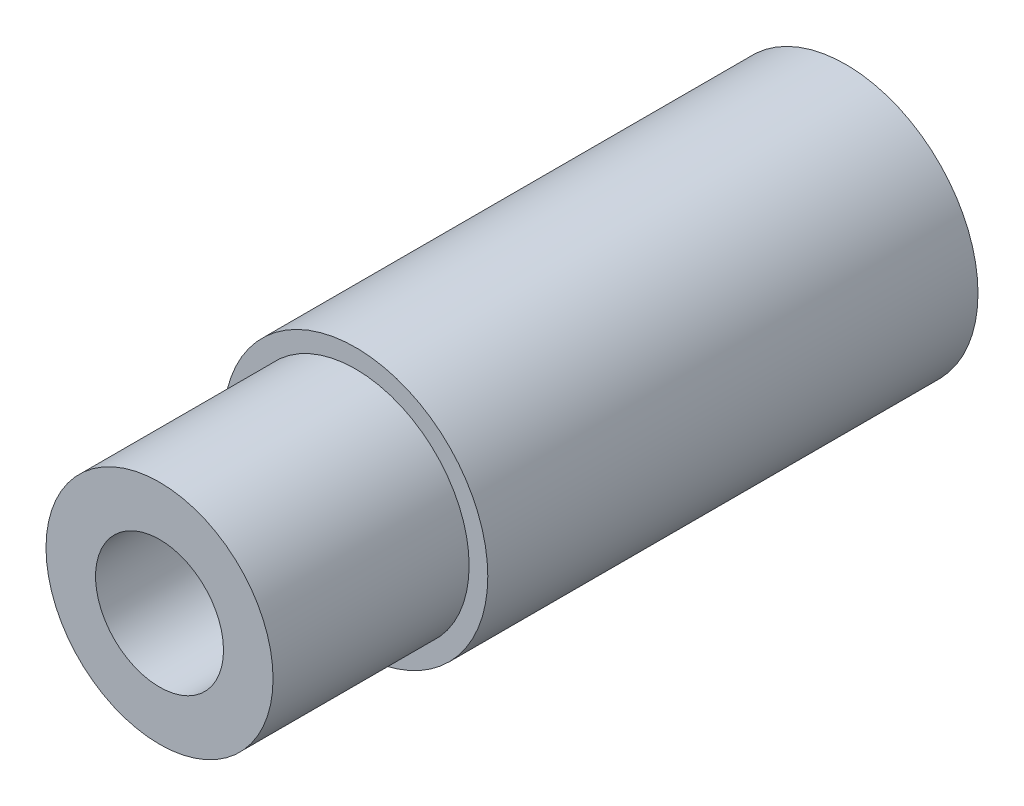
ISO-10303-21;
HEADER;
FILE_DESCRIPTION(('STEP AP214'),'2;1');
FILE_NAME('part.step','',(''),(''),'','','');
FILE_SCHEMA(('AUTOMOTIVE_DESIGN { 1 0 10303 214 1 1 1 1 }'));
ENDSEC;
DATA;
#1=APPLICATION_CONTEXT('core data for automotive mechanical design processes');
#2=APPLICATION_PROTOCOL_DEFINITION('international standard','automotive_design',2000,#1);
#3=PRODUCT_CONTEXT('',#1,'mechanical');
#4=PRODUCT('Part','Part','',(#3));
#5=PRODUCT_RELATED_PRODUCT_CATEGORY('part','',(#4));
#6=PRODUCT_DEFINITION_FORMATION('','',#4);
#7=PRODUCT_DEFINITION_CONTEXT('part definition',#1,'design');
#8=PRODUCT_DEFINITION('design','',#6,#7);
#9=PRODUCT_DEFINITION_SHAPE('','',#8);
#10=(LENGTH_UNIT() NAMED_UNIT(*) SI_UNIT(.MILLI.,.METRE.));
#11=(NAMED_UNIT(*) PLANE_ANGLE_UNIT() SI_UNIT($,.RADIAN.));
#12=(NAMED_UNIT(*) SI_UNIT($,.STERADIAN.) SOLID_ANGLE_UNIT());
#13=UNCERTAINTY_MEASURE_WITH_UNIT(LENGTH_MEASURE(1.E-05),#10,'distance_accuracy_value','');
#14=(GEOMETRIC_REPRESENTATION_CONTEXT(3) GLOBAL_UNCERTAINTY_ASSIGNED_CONTEXT((#13)) GLOBAL_UNIT_ASSIGNED_CONTEXT((#10,
#11,#12)) REPRESENTATION_CONTEXT('',''));
#15=CARTESIAN_POINT('',(0.,0.,0.));
#16=DIRECTION('',(0.,0.,1.));
#17=DIRECTION('',(1.,0.,0.));
#18=AXIS2_PLACEMENT_3D('',#15,#16,#17);
#19=CARTESIAN_POINT('',(0.,0.,12.065));
#20=DIRECTION('',(0.,0.,1.));
#21=DIRECTION('',(1.,0.,0.));
#22=AXIS2_PLACEMENT_3D('',#19,#20,#21);
#23=PLANE('',#22);
#24=CARTESIAN_POINT('',(0.,0.,12.065));
#25=DIRECTION('',(0.,0.,1.));
#26=DIRECTION('',(1.,0.,0.));
#27=AXIS2_PLACEMENT_3D('',#24,#25,#26);
#28=CIRCLE('',#27,3.25374);
#29=CARTESIAN_POINT('',(3.25374,0.,12.065));
#30=VERTEX_POINT('',#29);
#31=EDGE_CURVE('E10',#30,#30,#28,.T.);
#32=ORIENTED_EDGE('',*,*,#31,.T.);
#33=EDGE_LOOP('',(#32));
#34=FACE_BOUND('',#33,.T.);
#35=CARTESIAN_POINT('',(0.,0.,12.065));
#36=DIRECTION('',(0.,0.,1.));
#37=DIRECTION('',(1.,0.,0.));
#38=AXIS2_PLACEMENT_3D('',#35,#36,#37);
#39=CIRCLE('',#38,2.794);
#40=CARTESIAN_POINT('',(2.794,0.,12.065));
#41=VERTEX_POINT('',#40);
#42=EDGE_CURVE('E49',#41,#41,#39,.T.);
#43=ORIENTED_EDGE('',*,*,#42,.F.);
#44=EDGE_LOOP('',(#43));
#45=FACE_BOUND('',#44,.T.);
#46=ADVANCED_FACE('F33',(#34,#45),#23,.T.);
#47=CARTESIAN_POINT('',(0.,0.,0.));
#48=DIRECTION('',(0.,0.,1.));
#49=DIRECTION('',(1.,0.,0.));
#50=AXIS2_PLACEMENT_3D('',#47,#48,#49);
#51=PLANE('',#50);
#52=CARTESIAN_POINT('',(0.,0.,0.));
#53=DIRECTION('',(0.,0.,1.));
#54=DIRECTION('',(1.,0.,0.));
#55=AXIS2_PLACEMENT_3D('',#52,#53,#54);
#56=CIRCLE('',#55,3.25374);
#57=CARTESIAN_POINT('',(3.25374,0.,0.));
#58=VERTEX_POINT('',#57);
#59=EDGE_CURVE('E37',#58,#58,#56,.T.);
#60=ORIENTED_EDGE('',*,*,#59,.F.);
#61=EDGE_LOOP('',(#60));
#62=FACE_BOUND('',#61,.T.);
#63=CARTESIAN_POINT('',(0.,0.,0.));
#64=DIRECTION('',(0.,0.,1.));
#65=DIRECTION('',(1.,0.,0.));
#66=AXIS2_PLACEMENT_3D('',#63,#64,#65);
#67=CIRCLE('',#66,1.5748);
#68=CARTESIAN_POINT('',(1.5748,0.,0.));
#69=VERTEX_POINT('',#68);
#70=EDGE_CURVE('E44',#69,#69,#67,.T.);
#71=ORIENTED_EDGE('',*,*,#70,.T.);
#72=EDGE_LOOP('',(#71));
#73=FACE_BOUND('',#72,.T.);
#74=ADVANCED_FACE('F74',(#62,#73),#51,.F.);
#75=CARTESIAN_POINT('',(0.,0.,12.065));
#76=DIRECTION('',(0.,0.,-1.));
#77=DIRECTION('',(-1.,0.,0.));
#78=AXIS2_PLACEMENT_3D('',#75,#76,#77);
#79=CYLINDRICAL_SURFACE('',#78,3.25374);
#80=ORIENTED_EDGE('',*,*,#31,.F.);
#81=EDGE_LOOP('',(#80));
#82=FACE_BOUND('',#81,.T.);
#83=ORIENTED_EDGE('',*,*,#59,.T.);
#84=EDGE_LOOP('',(#83));
#85=FACE_BOUND('',#84,.T.);
#86=ADVANCED_FACE('F35',(#82,#85),#79,.T.);
#87=CARTESIAN_POINT('',(0.,0.,12.065));
#88=DIRECTION('',(0.,0.,-1.));
#89=DIRECTION('',(-1.,0.,0.));
#90=AXIS2_PLACEMENT_3D('',#87,#88,#89);
#91=CYLINDRICAL_SURFACE('',#90,1.5748);
#92=ORIENTED_EDGE('',*,*,#70,.F.);
#93=EDGE_LOOP('',(#92));
#94=FACE_BOUND('',#93,.T.);
#95=CARTESIAN_POINT('',(0.,0.,16.891));
#96=DIRECTION('',(0.,0.,1.));
#97=DIRECTION('',(1.,0.,0.));
#98=AXIS2_PLACEMENT_3D('',#95,#96,#97);
#99=CIRCLE('',#98,1.5748);
#100=CARTESIAN_POINT('',(1.5748,0.,16.891));
#101=VERTEX_POINT('',#100);
#102=EDGE_CURVE('E52',#101,#101,#99,.T.);
#103=ORIENTED_EDGE('',*,*,#102,.T.);
#104=EDGE_LOOP('',(#103));
#105=FACE_BOUND('',#104,.T.);
#106=ADVANCED_FACE('F58',(#94,#105),#91,.F.);
#107=CARTESIAN_POINT('',(0.,0.,16.891));
#108=DIRECTION('',(0.,0.,1.));
#109=DIRECTION('',(1.,0.,0.));
#110=AXIS2_PLACEMENT_3D('',#107,#108,#109);
#111=PLANE('',#110);
#112=CARTESIAN_POINT('',(0.,0.,16.891));
#113=DIRECTION('',(0.,0.,1.));
#114=DIRECTION('',(1.,0.,0.));
#115=AXIS2_PLACEMENT_3D('',#112,#113,#114);
#116=CIRCLE('',#115,2.794);
#117=CARTESIAN_POINT('',(2.794,0.,16.891));
#118=VERTEX_POINT('',#117);
#119=EDGE_CURVE('E48',#118,#118,#116,.T.);
#120=ORIENTED_EDGE('',*,*,#119,.T.);
#121=EDGE_LOOP('',(#120));
#122=FACE_BOUND('',#121,.T.);
#123=ORIENTED_EDGE('',*,*,#102,.F.);
#124=EDGE_LOOP('',(#123));
#125=FACE_BOUND('',#124,.T.);
#126=ADVANCED_FACE('F60',(#122,#125),#111,.T.);
#127=CARTESIAN_POINT('',(0.,0.,16.891));
#128=DIRECTION('',(0.,0.,-1.));
#129=DIRECTION('',(-1.,0.,0.));
#130=AXIS2_PLACEMENT_3D('',#127,#128,#129);
#131=CYLINDRICAL_SURFACE('',#130,2.794);
#132=ORIENTED_EDGE('',*,*,#119,.F.);
#133=EDGE_LOOP('',(#132));
#134=FACE_BOUND('',#133,.T.);
#135=ORIENTED_EDGE('',*,*,#42,.T.);
#136=EDGE_LOOP('',(#135));
#137=FACE_BOUND('',#136,.T.);
#138=ADVANCED_FACE('F62',(#134,#137),#131,.T.);
#139=CLOSED_SHELL('',(#46,#74,#86,#106,#126,#138));
#140=MANIFOLD_SOLID_BREP('B2',#139);
#141=ADVANCED_BREP_SHAPE_REPRESENTATION('',(#18,#140),#14);
#142=SHAPE_DEFINITION_REPRESENTATION(#9,#141);
ENDSEC;
END-ISO-10303-21;
